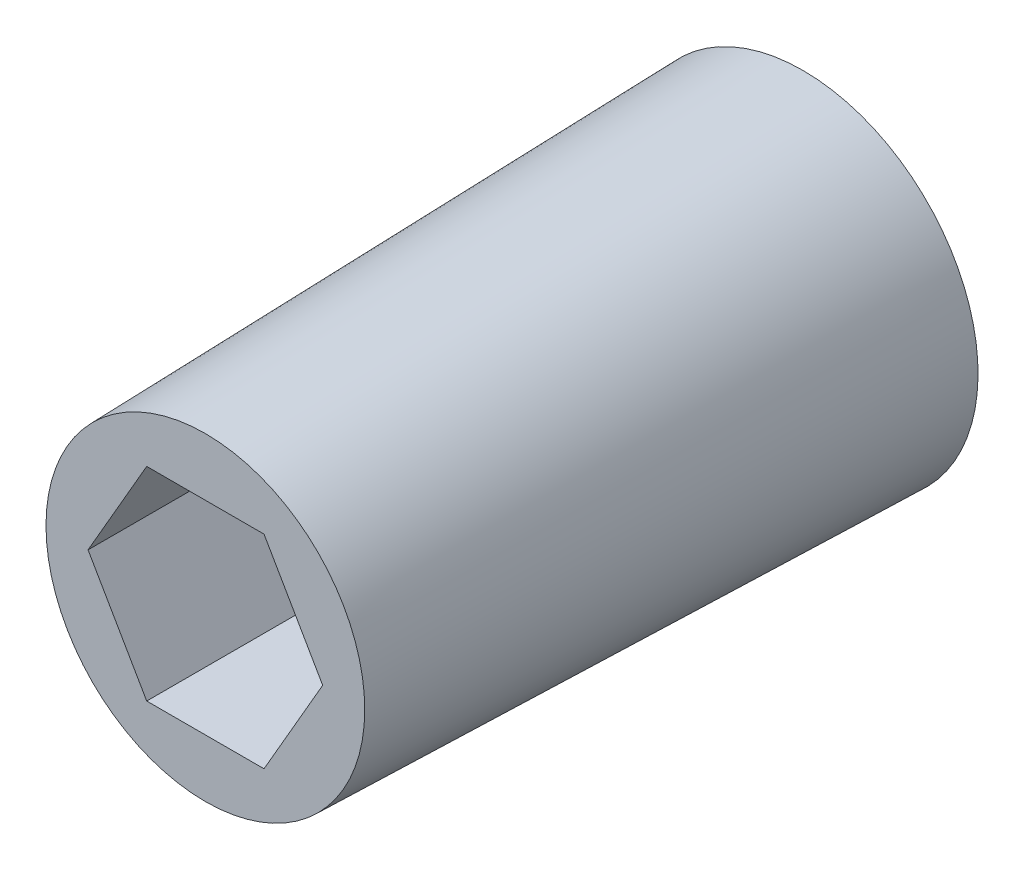
ISO-10303-21;
HEADER;
FILE_DESCRIPTION(('STEP AP214'),'2;1');
FILE_NAME('part.step','',(''),(''),'','','');
FILE_SCHEMA(('AUTOMOTIVE_DESIGN { 1 0 10303 214 1 1 1 1 }'));
ENDSEC;
DATA;
#1=APPLICATION_CONTEXT('core data for automotive mechanical design processes');
#2=APPLICATION_PROTOCOL_DEFINITION('international standard','automotive_design',2000,#1);
#3=PRODUCT_CONTEXT('',#1,'mechanical');
#4=PRODUCT('Part','Part','',(#3));
#5=PRODUCT_RELATED_PRODUCT_CATEGORY('part','',(#4));
#6=PRODUCT_DEFINITION_FORMATION('','',#4);
#7=PRODUCT_DEFINITION_CONTEXT('part definition',#1,'design');
#8=PRODUCT_DEFINITION('design','',#6,#7);
#9=PRODUCT_DEFINITION_SHAPE('','',#8);
#10=(LENGTH_UNIT() NAMED_UNIT(*) SI_UNIT(.MILLI.,.METRE.));
#11=(NAMED_UNIT(*) PLANE_ANGLE_UNIT() SI_UNIT($,.RADIAN.));
#12=(NAMED_UNIT(*) SI_UNIT($,.STERADIAN.) SOLID_ANGLE_UNIT());
#13=UNCERTAINTY_MEASURE_WITH_UNIT(LENGTH_MEASURE(1.E-05),#10,'distance_accuracy_value','');
#14=(GEOMETRIC_REPRESENTATION_CONTEXT(3) GLOBAL_UNCERTAINTY_ASSIGNED_CONTEXT((#13)) GLOBAL_UNIT_ASSIGNED_CONTEXT((#10,
#11,#12)) REPRESENTATION_CONTEXT('',''));
#15=CARTESIAN_POINT('',(0.,0.,0.));
#16=DIRECTION('',(0.,0.,1.));
#17=DIRECTION('',(1.,0.,0.));
#18=AXIS2_PLACEMENT_3D('',#15,#16,#17);
#19=CARTESIAN_POINT('',(-1.47224318643354,-2.55,0.));
#20=DIRECTION('',(0.,-1.,0.));
#21=DIRECTION('',(0.,0.,-1.));
#22=AXIS2_PLACEMENT_3D('',#19,#20,#21);
#23=PLANE('',#22);
#24=DIRECTION('',(0.,0.,1.));
#25=VECTOR('',#24,1.);
#26=CARTESIAN_POINT('',(-1.47224318643355,-2.55,0.));
#27=LINE('',#26,#25);
#28=CARTESIAN_POINT('',(-1.47224318643355,-2.55,-7.5));
#29=VERTEX_POINT('',#28);
#30=CARTESIAN_POINT('',(-1.47224318643355,-2.55,7.5));
#31=VERTEX_POINT('',#30);
#32=EDGE_CURVE('E97',#29,#31,#27,.T.);
#33=ORIENTED_EDGE('',*,*,#32,.T.);
#34=DIRECTION('',(1.,0.,0.));
#35=VECTOR('',#34,1.);
#36=CARTESIAN_POINT('',(0.,-2.55,7.5));
#37=LINE('',#36,#35);
#38=CARTESIAN_POINT('',(1.47224318643355,-2.55,7.5));
#39=VERTEX_POINT('',#38);
#40=EDGE_CURVE('E83',#39,#31,#37,.F.);
#41=ORIENTED_EDGE('',*,*,#40,.F.);
#42=DIRECTION('',(0.,0.,1.));
#43=VECTOR('',#42,1.);
#44=CARTESIAN_POINT('',(1.47224318643355,-2.55,0.));
#45=LINE('',#44,#43);
#46=CARTESIAN_POINT('',(1.47224318643355,-2.55,-7.5));
#47=VERTEX_POINT('',#46);
#48=EDGE_CURVE('E75',#39,#47,#45,.F.);
#49=ORIENTED_EDGE('',*,*,#48,.T.);
#50=DIRECTION('',(1.,0.,0.));
#51=VECTOR('',#50,1.);
#52=CARTESIAN_POINT('',(0.,-2.55,-7.5));
#53=LINE('',#52,#51);
#54=EDGE_CURVE('E102',#47,#29,#53,.F.);
#55=ORIENTED_EDGE('',*,*,#54,.T.);
#56=EDGE_LOOP('',(#33,#41,#49,#55));
#57=FACE_BOUND('',#56,.T.);
#58=ADVANCED_FACE('F16',(#57),#23,.F.);
#59=CARTESIAN_POINT('',(-2.94448637286709,0.,0.));
#60=DIRECTION('',(-0.866025403784439,-0.5,0.));
#61=DIRECTION('',(0.5,-0.866025403784439,0.));
#62=AXIS2_PLACEMENT_3D('',#59,#60,#61);
#63=PLANE('',#62);
#64=DIRECTION('',(0.,0.,1.));
#65=VECTOR('',#64,1.);
#66=CARTESIAN_POINT('',(-2.94448637286709,0.,0.));
#67=LINE('',#66,#65);
#68=CARTESIAN_POINT('',(-2.94448637286709,0.,-7.5));
#69=VERTEX_POINT('',#68);
#70=CARTESIAN_POINT('',(-2.94448637286709,0.,7.5));
#71=VERTEX_POINT('',#70);
#72=EDGE_CURVE('E95',#69,#71,#67,.T.);
#73=ORIENTED_EDGE('',*,*,#72,.T.);
#74=DIRECTION('',(-0.5,0.866025403784439,0.));
#75=VECTOR('',#74,1.);
#76=CARTESIAN_POINT('',(-1.47224318643355,-2.55,7.5));
#77=LINE('',#76,#75);
#78=EDGE_CURVE('E106',#31,#71,#77,.T.);
#79=ORIENTED_EDGE('',*,*,#78,.F.);
#80=ORIENTED_EDGE('',*,*,#32,.F.);
#81=DIRECTION('',(-0.5,0.866025403784439,0.));
#82=VECTOR('',#81,1.);
#83=CARTESIAN_POINT('',(-1.47224318643355,-2.55,-7.5));
#84=LINE('',#83,#82);
#85=EDGE_CURVE('E116',#29,#69,#84,.T.);
#86=ORIENTED_EDGE('',*,*,#85,.T.);
#87=EDGE_LOOP('',(#73,#79,#80,#86));
#88=FACE_BOUND('',#87,.T.);
#89=ADVANCED_FACE('F107',(#88),#63,.F.);
#90=CARTESIAN_POINT('',(-1.47224318643355,2.55,0.));
#91=DIRECTION('',(-0.866025403784439,0.5,0.));
#92=DIRECTION('',(-0.5,-0.866025403784439,0.));
#93=AXIS2_PLACEMENT_3D('',#90,#91,#92);
#94=PLANE('',#93);
#95=DIRECTION('',(0.,0.,1.));
#96=VECTOR('',#95,1.);
#97=CARTESIAN_POINT('',(-1.47224318643355,2.55,0.));
#98=LINE('',#97,#96);
#99=CARTESIAN_POINT('',(-1.47224318643355,2.55,-7.5));
#100=VERTEX_POINT('',#99);
#101=CARTESIAN_POINT('',(-1.47224318643355,2.55,7.5));
#102=VERTEX_POINT('',#101);
#103=EDGE_CURVE('E93',#100,#102,#98,.T.);
#104=ORIENTED_EDGE('',*,*,#103,.T.);
#105=DIRECTION('',(0.5,0.866025403784439,0.));
#106=VECTOR('',#105,1.);
#107=CARTESIAN_POINT('',(-2.94448637286709,0.,7.5));
#108=LINE('',#107,#106);
#109=EDGE_CURVE('E110',#71,#102,#108,.T.);
#110=ORIENTED_EDGE('',*,*,#109,.F.);
#111=ORIENTED_EDGE('',*,*,#72,.F.);
#112=DIRECTION('',(0.5,0.866025403784439,0.));
#113=VECTOR('',#112,1.);
#114=CARTESIAN_POINT('',(-2.94448637286709,0.,-7.5));
#115=LINE('',#114,#113);
#116=EDGE_CURVE('E118',#69,#100,#115,.T.);
#117=ORIENTED_EDGE('',*,*,#116,.T.);
#118=EDGE_LOOP('',(#104,#110,#111,#117));
#119=FACE_BOUND('',#118,.T.);
#120=ADVANCED_FACE('F150',(#119),#94,.F.);
#121=CARTESIAN_POINT('',(1.47224318643355,2.55,0.));
#122=DIRECTION('',(0.,1.,0.));
#123=DIRECTION('',(0.,0.,1.));
#124=AXIS2_PLACEMENT_3D('',#121,#122,#123);
#125=PLANE('',#124);
#126=DIRECTION('',(0.,0.,1.));
#127=VECTOR('',#126,1.);
#128=CARTESIAN_POINT('',(1.47224318643355,2.55,0.));
#129=LINE('',#128,#127);
#130=CARTESIAN_POINT('',(1.47224318643355,2.55,-7.5));
#131=VERTEX_POINT('',#130);
#132=CARTESIAN_POINT('',(1.47224318643355,2.55,7.5));
#133=VERTEX_POINT('',#132);
#134=EDGE_CURVE('E64',#131,#133,#129,.T.);
#135=ORIENTED_EDGE('',*,*,#134,.T.);
#136=DIRECTION('',(1.,0.,0.));
#137=VECTOR('',#136,1.);
#138=CARTESIAN_POINT('',(0.,2.55,7.5));
#139=LINE('',#138,#137);
#140=EDGE_CURVE('E87',#102,#133,#139,.T.);
#141=ORIENTED_EDGE('',*,*,#140,.F.);
#142=ORIENTED_EDGE('',*,*,#103,.F.);
#143=DIRECTION('',(1.,0.,0.));
#144=VECTOR('',#143,1.);
#145=CARTESIAN_POINT('',(0.,2.55,-7.5));
#146=LINE('',#145,#144);
#147=EDGE_CURVE('E120',#100,#131,#146,.T.);
#148=ORIENTED_EDGE('',*,*,#147,.T.);
#149=EDGE_LOOP('',(#135,#141,#142,#148));
#150=FACE_BOUND('',#149,.T.);
#151=ADVANCED_FACE('F152',(#150),#125,.F.);
#152=CARTESIAN_POINT('',(2.94448637286709,0.,0.));
#153=DIRECTION('',(0.866025403784439,0.5,0.));
#154=DIRECTION('',(-0.5,0.866025403784439,0.));
#155=AXIS2_PLACEMENT_3D('',#152,#153,#154);
#156=PLANE('',#155);
#157=DIRECTION('',(0.,0.,1.));
#158=VECTOR('',#157,1.);
#159=CARTESIAN_POINT('',(2.94448637286709,0.,0.));
#160=LINE('',#159,#158);
#161=CARTESIAN_POINT('',(2.94448637286709,0.,-7.5));
#162=VERTEX_POINT('',#161);
#163=CARTESIAN_POINT('',(2.94448637286709,0.,7.5));
#164=VERTEX_POINT('',#163);
#165=EDGE_CURVE('E66',#162,#164,#160,.T.);
#166=ORIENTED_EDGE('',*,*,#165,.T.);
#167=DIRECTION('',(0.5,-0.866025403784439,0.));
#168=VECTOR('',#167,1.);
#169=CARTESIAN_POINT('',(1.47224318643355,2.55,7.5));
#170=LINE('',#169,#168);
#171=EDGE_CURVE('E70',#133,#164,#170,.T.);
#172=ORIENTED_EDGE('',*,*,#171,.F.);
#173=ORIENTED_EDGE('',*,*,#134,.F.);
#174=DIRECTION('',(0.5,-0.866025403784439,0.));
#175=VECTOR('',#174,1.);
#176=CARTESIAN_POINT('',(1.47224318643355,2.55,-7.5));
#177=LINE('',#176,#175);
#178=EDGE_CURVE('E32',#131,#162,#177,.T.);
#179=ORIENTED_EDGE('',*,*,#178,.T.);
#180=EDGE_LOOP('',(#166,#172,#173,#179));
#181=FACE_BOUND('',#180,.T.);
#182=ADVANCED_FACE('F68',(#181),#156,.F.);
#183=CARTESIAN_POINT('',(1.47224318643355,-2.55,0.));
#184=DIRECTION('',(0.866025403784439,-0.5,0.));
#185=DIRECTION('',(0.5,0.866025403784439,0.));
#186=AXIS2_PLACEMENT_3D('',#183,#184,#185);
#187=PLANE('',#186);
#188=ORIENTED_EDGE('',*,*,#48,.F.);
#189=DIRECTION('',(-0.5,-0.866025403784439,0.));
#190=VECTOR('',#189,1.);
#191=CARTESIAN_POINT('',(2.94448637286709,0.,7.5));
#192=LINE('',#191,#190);
#193=EDGE_CURVE('E78',#164,#39,#192,.T.);
#194=ORIENTED_EDGE('',*,*,#193,.F.);
#195=ORIENTED_EDGE('',*,*,#165,.F.);
#196=DIRECTION('',(-0.5,-0.866025403784439,0.));
#197=VECTOR('',#196,1.);
#198=CARTESIAN_POINT('',(2.94448637286709,0.,-7.5));
#199=LINE('',#198,#197);
#200=EDGE_CURVE('E123',#162,#47,#199,.T.);
#201=ORIENTED_EDGE('',*,*,#200,.T.);
#202=EDGE_LOOP('',(#188,#194,#195,#201));
#203=FACE_BOUND('',#202,.T.);
#204=ADVANCED_FACE('F79',(#203),#187,.F.);
#205=CARTESIAN_POINT('',(0.,0.,7.5));
#206=DIRECTION('',(0.,0.,1.));
#207=DIRECTION('',(1.,0.,0.));
#208=AXIS2_PLACEMENT_3D('',#205,#206,#207);
#209=PLANE('',#208);
#210=CARTESIAN_POINT('',(0.,0.,7.49999999999318));
#211=DIRECTION('',(0.,0.,-1.));
#212=DIRECTION('',(0.,1.,0.));
#213=AXIS2_PLACEMENT_3D('',#210,#211,#212);
#214=CIRCLE('',#213,3.99999999999721);
#215=CARTESIAN_POINT('',(0.,3.99999999999721,7.49999999999318));
#216=VERTEX_POINT('',#215);
#217=EDGE_CURVE('E19',#216,#216,#214,.T.);
#218=ORIENTED_EDGE('',*,*,#217,.F.);
#219=EDGE_LOOP('',(#218));
#220=FACE_BOUND('',#219,.T.);
#221=ORIENTED_EDGE('',*,*,#109,.T.);
#222=ORIENTED_EDGE('',*,*,#140,.T.);
#223=ORIENTED_EDGE('',*,*,#171,.T.);
#224=ORIENTED_EDGE('',*,*,#193,.T.);
#225=ORIENTED_EDGE('',*,*,#40,.T.);
#226=ORIENTED_EDGE('',*,*,#78,.T.);
#227=EDGE_LOOP('',(#221,#222,#223,#224,#225,#226));
#228=FACE_BOUND('',#227,.T.);
#229=ADVANCED_FACE('F86',(#220,#228),#209,.T.);
#230=CARTESIAN_POINT('',(0.,0.,-7.5));
#231=DIRECTION('',(0.,0.,1.));
#232=DIRECTION('',(1.,0.,0.));
#233=AXIS2_PLACEMENT_3D('',#230,#231,#232);
#234=PLANE('',#233);
#235=CARTESIAN_POINT('',(0.,0.,-7.49999999999318));
#236=DIRECTION('',(0.,0.,-1.));
#237=DIRECTION('',(0.,1.,0.));
#238=AXIS2_PLACEMENT_3D('',#235,#236,#237);
#239=CIRCLE('',#238,4.39278882308556);
#240=CARTESIAN_POINT('',(0.,4.39278882308556,-7.49999999999318));
#241=VERTEX_POINT('',#240);
#242=EDGE_CURVE('E11',#241,#241,#239,.F.);
#243=ORIENTED_EDGE('',*,*,#242,.F.);
#244=EDGE_LOOP('',(#243));
#245=FACE_BOUND('',#244,.T.);
#246=ORIENTED_EDGE('',*,*,#178,.F.);
#247=ORIENTED_EDGE('',*,*,#147,.F.);
#248=ORIENTED_EDGE('',*,*,#116,.F.);
#249=ORIENTED_EDGE('',*,*,#85,.F.);
#250=ORIENTED_EDGE('',*,*,#54,.F.);
#251=ORIENTED_EDGE('',*,*,#200,.F.);
#252=EDGE_LOOP('',(#246,#247,#248,#249,#250,#251));
#253=FACE_BOUND('',#252,.T.);
#254=ADVANCED_FACE('F130',(#245,#253),#234,.F.);
#255=CARTESIAN_POINT('',(0.,0.,-7.49999999987949));
#256=DIRECTION('',(0.,0.,-1.));
#257=DIRECTION('',(0.,1.,0.));
#258=AXIS2_PLACEMENT_3D('',#255,#256,#257);
#259=CONICAL_SURFACE('',#258,4.39278882308258,0.0261799387499958);
#260=ORIENTED_EDGE('',*,*,#242,.T.);
#261=EDGE_LOOP('',(#260));
#262=FACE_BOUND('',#261,.T.);
#263=ORIENTED_EDGE('',*,*,#217,.T.);
#264=EDGE_LOOP('',(#263));
#265=FACE_BOUND('',#264,.T.);
#266=ADVANCED_FACE('F127',(#262,#265),#259,.T.);
#267=CLOSED_SHELL('',(#58,#89,#120,#151,#182,#204,#229,#254,#266));
#268=MANIFOLD_SOLID_BREP('B1',#267);
#269=ADVANCED_BREP_SHAPE_REPRESENTATION('',(#18,#268),#14);
#270=SHAPE_DEFINITION_REPRESENTATION(#9,#269);
ENDSEC;
END-ISO-10303-21;
